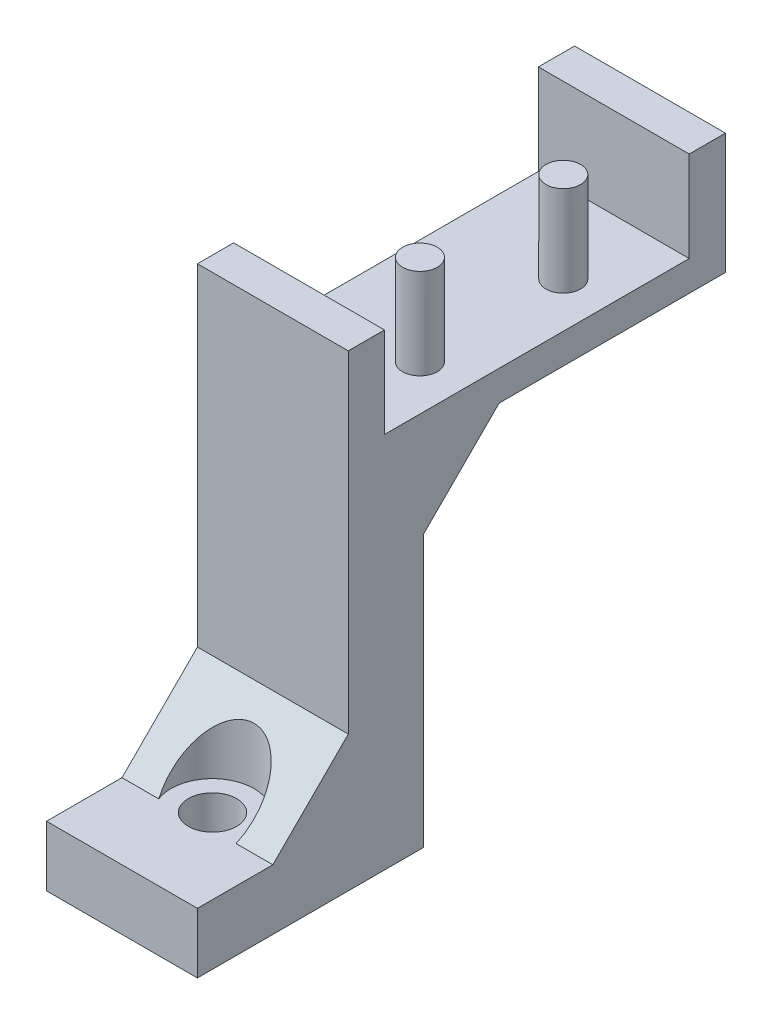
ISO-10303-21;
HEADER;
FILE_DESCRIPTION(('STEP AP214'),'2;1');
FILE_NAME('part.step','',(''),(''),'','','');
FILE_SCHEMA(('AUTOMOTIVE_DESIGN { 1 0 10303 214 1 1 1 1 }'));
ENDSEC;
DATA;
#1=APPLICATION_CONTEXT('core data for automotive mechanical design processes');
#2=APPLICATION_PROTOCOL_DEFINITION('international standard','automotive_design',2000,#1);
#3=PRODUCT_CONTEXT('',#1,'mechanical');
#4=PRODUCT('Part','Part','',(#3));
#5=PRODUCT_RELATED_PRODUCT_CATEGORY('part','',(#4));
#6=PRODUCT_DEFINITION_FORMATION('','',#4);
#7=PRODUCT_DEFINITION_CONTEXT('part definition',#1,'design');
#8=PRODUCT_DEFINITION('design','',#6,#7);
#9=PRODUCT_DEFINITION_SHAPE('','',#8);
#10=(LENGTH_UNIT() NAMED_UNIT(*) SI_UNIT(.MILLI.,.METRE.));
#11=(NAMED_UNIT(*) PLANE_ANGLE_UNIT() SI_UNIT($,.RADIAN.));
#12=(NAMED_UNIT(*) SI_UNIT($,.STERADIAN.) SOLID_ANGLE_UNIT());
#13=UNCERTAINTY_MEASURE_WITH_UNIT(LENGTH_MEASURE(1.E-05),#10,'distance_accuracy_value','');
#14=(GEOMETRIC_REPRESENTATION_CONTEXT(3) GLOBAL_UNCERTAINTY_ASSIGNED_CONTEXT((#13)) GLOBAL_UNIT_ASSIGNED_CONTEXT((#10,
#11,#12)) REPRESENTATION_CONTEXT('',''));
#15=CARTESIAN_POINT('',(0.,0.,0.));
#16=DIRECTION('',(0.,0.,1.));
#17=DIRECTION('',(1.,0.,0.));
#18=AXIS2_PLACEMENT_3D('',#15,#16,#17);
#19=CARTESIAN_POINT('',(5.,4.,-4.99999999999996));
#20=DIRECTION('',(0.,0.707106781186552,0.707106781186544));
#21=DIRECTION('',(1.,0.,0.));
#22=AXIS2_PLACEMENT_3D('',#19,#20,#21);
#23=PLANE('',#22);
#24=CARTESIAN_POINT('',(0.,5.00000000000003,-6.));
#25=DIRECTION('',(0.,0.707106781186552,0.707106781186544));
#26=DIRECTION('',(0.,-0.707106781186544,0.707106781186552));
#27=AXIS2_PLACEMENT_3D('',#24,#25,#26);
#28=ELLIPSE('',#27,3.88908729652599,2.75);
#29=CARTESIAN_POINT('',(2.56173769148988,4.,-4.99999999999996));
#30=VERTEX_POINT('',#29);
#31=CARTESIAN_POINT('',(-2.56173769148988,4.,-4.99999999999996));
#32=VERTEX_POINT('',#31);
#33=EDGE_CURVE('E11',#30,#32,#28,.T.);
#34=ORIENTED_EDGE('',*,*,#33,.F.);
#35=DIRECTION('',(-1.,0.,0.));
#36=VECTOR('',#35,1.);
#37=CARTESIAN_POINT('',(-5.,4.,-4.99999999999996));
#38=LINE('',#37,#36);
#39=CARTESIAN_POINT('',(5.,4.,-4.99999999999996));
#40=VERTEX_POINT('',#39);
#41=EDGE_CURVE('E164',#40,#30,#38,.T.);
#42=ORIENTED_EDGE('',*,*,#41,.F.);
#43=DIRECTION('',(0.,0.707106781186544,-0.707106781186552));
#44=VECTOR('',#43,1.);
#45=CARTESIAN_POINT('',(5.,4.,-4.99999999999996));
#46=LINE('',#45,#44);
#47=CARTESIAN_POINT('',(5.,8.99999999999998,-10.));
#48=VERTEX_POINT('',#47);
#49=EDGE_CURVE('E191',#48,#40,#46,.F.);
#50=ORIENTED_EDGE('',*,*,#49,.F.);
#51=DIRECTION('',(1.,0.,0.));
#52=VECTOR('',#51,1.);
#53=CARTESIAN_POINT('',(5.,8.99999999999998,-10.));
#54=LINE('',#53,#52);
#55=CARTESIAN_POINT('',(-5.,8.99999999999998,-10.));
#56=VERTEX_POINT('',#55);
#57=EDGE_CURVE('E173',#56,#48,#54,.T.);
#58=ORIENTED_EDGE('',*,*,#57,.F.);
#59=DIRECTION('',(0.,-0.707106781186544,0.707106781186552));
#60=VECTOR('',#59,1.);
#61=CARTESIAN_POINT('',(-5.,-0.499999999999958,-0.499999999999952));
#62=LINE('',#61,#60);
#63=CARTESIAN_POINT('',(-5.,4.,-4.99999999999996));
#64=VERTEX_POINT('',#63);
#65=EDGE_CURVE('E188',#64,#56,#62,.F.);
#66=ORIENTED_EDGE('',*,*,#65,.F.);
#67=EDGE_CURVE('E166',#32,#64,#38,.T.);
#68=ORIENTED_EDGE('',*,*,#67,.F.);
#69=EDGE_LOOP('',(#34,#42,#50,#58,#66,#68));
#70=FACE_BOUND('',#69,.T.);
#71=ADVANCED_FACE('F43',(#70),#23,.T.);
#72=CARTESIAN_POINT('',(0.,31.,-6.));
#73=DIRECTION('',(0.,-1.,0.));
#74=DIRECTION('',(0.,0.,-1.));
#75=AXIS2_PLACEMENT_3D('',#72,#73,#74);
#76=CYLINDRICAL_SURFACE('',#75,1.6);
#77=CARTESIAN_POINT('',(0.,0.,-6.));
#78=DIRECTION('',(0.,-1.,0.));
#79=DIRECTION('',(0.,0.,-1.));
#80=AXIS2_PLACEMENT_3D('',#77,#78,#79);
#81=CIRCLE('',#80,1.6);
#82=CARTESIAN_POINT('',(0.,0.,-7.6));
#83=VERTEX_POINT('',#82);
#84=EDGE_CURVE('E159',#83,#83,#81,.T.);
#85=ORIENTED_EDGE('',*,*,#84,.T.);
#86=EDGE_LOOP('',(#85));
#87=FACE_BOUND('',#86,.T.);
#88=CARTESIAN_POINT('',(0.,4.,-6.));
#89=DIRECTION('',(0.,-1.,0.));
#90=DIRECTION('',(0.,0.,-1.));
#91=AXIS2_PLACEMENT_3D('',#88,#89,#90);
#92=CIRCLE('',#91,1.6);
#93=CARTESIAN_POINT('',(0.,4.,-7.6));
#94=VERTEX_POINT('',#93);
#95=EDGE_CURVE('E417',#94,#94,#92,.T.);
#96=ORIENTED_EDGE('',*,*,#95,.F.);
#97=EDGE_LOOP('',(#96));
#98=FACE_BOUND('',#97,.T.);
#99=ADVANCED_FACE('F225',(#87,#98),#76,.F.);
#100=CARTESIAN_POINT('',(5.,31.,-35.));
#101=DIRECTION('',(0.,-1.,0.));
#102=DIRECTION('',(0.,0.,-1.));
#103=AXIS2_PLACEMENT_3D('',#100,#101,#102);
#104=PLANE('',#103);
#105=DIRECTION('',(0.,0.,1.));
#106=VECTOR('',#105,1.);
#107=CARTESIAN_POINT('',(-5.,31.,-35.));
#108=LINE('',#107,#106);
#109=CARTESIAN_POINT('',(-5.,31.,-35.));
#110=VERTEX_POINT('',#109);
#111=CARTESIAN_POINT('',(-5.,31.,-32.6));
#112=VERTEX_POINT('',#111);
#113=EDGE_CURVE('E335',#110,#112,#108,.T.);
#114=ORIENTED_EDGE('',*,*,#113,.T.);
#115=DIRECTION('',(-1.,0.,0.));
#116=VECTOR('',#115,1.);
#117=CARTESIAN_POINT('',(-5.,31.,-32.6));
#118=LINE('',#117,#116);
#119=CARTESIAN_POINT('',(5.,31.,-32.6));
#120=VERTEX_POINT('',#119);
#121=EDGE_CURVE('E394',#120,#112,#118,.T.);
#122=ORIENTED_EDGE('',*,*,#121,.F.);
#123=DIRECTION('',(0.,0.,1.));
#124=VECTOR('',#123,1.);
#125=CARTESIAN_POINT('',(5.,31.,-35.));
#126=LINE('',#125,#124);
#127=CARTESIAN_POINT('',(5.,31.,-35.));
#128=VERTEX_POINT('',#127);
#129=EDGE_CURVE('E363',#128,#120,#126,.T.);
#130=ORIENTED_EDGE('',*,*,#129,.F.);
#131=DIRECTION('',(-1.,0.,0.));
#132=VECTOR('',#131,1.);
#133=CARTESIAN_POINT('',(5.,31.,-35.));
#134=LINE('',#133,#132);
#135=EDGE_CURVE('E315',#128,#110,#134,.T.);
#136=ORIENTED_EDGE('',*,*,#135,.T.);
#137=EDGE_LOOP('',(#114,#122,#130,#136));
#138=FACE_BOUND('',#137,.T.);
#139=ADVANCED_FACE('F229',(#138),#104,.F.);
#140=CARTESIAN_POINT('',(5.,4.,0.));
#141=DIRECTION('',(0.,0.,-1.));
#142=DIRECTION('',(-1.,0.,0.));
#143=AXIS2_PLACEMENT_3D('',#140,#141,#142);
#144=PLANE('',#143);
#145=DIRECTION('',(0.,-1.,0.));
#146=VECTOR('',#145,1.);
#147=CARTESIAN_POINT('',(-5.,4.,0.));
#148=LINE('',#147,#146);
#149=CARTESIAN_POINT('',(-5.,4.,0.));
#150=VERTEX_POINT('',#149);
#151=CARTESIAN_POINT('',(-5.,0.,0.));
#152=VERTEX_POINT('',#151);
#153=EDGE_CURVE('E352',#150,#152,#148,.T.);
#154=ORIENTED_EDGE('',*,*,#153,.T.);
#155=DIRECTION('',(-1.,0.,0.));
#156=VECTOR('',#155,1.);
#157=CARTESIAN_POINT('',(5.,0.,0.));
#158=LINE('',#157,#156);
#159=CARTESIAN_POINT('',(5.,0.,0.));
#160=VERTEX_POINT('',#159);
#161=EDGE_CURVE('E302',#160,#152,#158,.T.);
#162=ORIENTED_EDGE('',*,*,#161,.F.);
#163=DIRECTION('',(0.,-1.,0.));
#164=VECTOR('',#163,1.);
#165=CARTESIAN_POINT('',(5.,4.,0.));
#166=LINE('',#165,#164);
#167=CARTESIAN_POINT('',(5.,4.,0.));
#168=VERTEX_POINT('',#167);
#169=EDGE_CURVE('E330',#168,#160,#166,.T.);
#170=ORIENTED_EDGE('',*,*,#169,.F.);
#171=DIRECTION('',(-1.,0.,0.));
#172=VECTOR('',#171,1.);
#173=CARTESIAN_POINT('',(5.,4.,0.));
#174=LINE('',#173,#172);
#175=EDGE_CURVE('E323',#168,#150,#174,.T.);
#176=ORIENTED_EDGE('',*,*,#175,.T.);
#177=EDGE_LOOP('',(#154,#162,#170,#176));
#178=FACE_BOUND('',#177,.T.);
#179=ADVANCED_FACE('F236',(#178),#144,.F.);
#180=CARTESIAN_POINT('',(5.,0.,0.));
#181=DIRECTION('',(0.,1.,0.));
#182=DIRECTION('',(0.,0.,1.));
#183=AXIS2_PLACEMENT_3D('',#180,#181,#182);
#184=PLANE('',#183);
#185=ORIENTED_EDGE('',*,*,#84,.F.);
#186=EDGE_LOOP('',(#185));
#187=FACE_BOUND('',#186,.T.);
#188=DIRECTION('',(0.,0.,-1.));
#189=VECTOR('',#188,1.);
#190=CARTESIAN_POINT('',(-5.,0.,0.));
#191=LINE('',#190,#189);
#192=CARTESIAN_POINT('',(-5.,0.,-15.));
#193=VERTEX_POINT('',#192);
#194=EDGE_CURVE('E349',#152,#193,#191,.T.);
#195=ORIENTED_EDGE('',*,*,#194,.T.);
#196=DIRECTION('',(-1.,0.,0.));
#197=VECTOR('',#196,1.);
#198=CARTESIAN_POINT('',(5.,0.,-15.));
#199=LINE('',#198,#197);
#200=CARTESIAN_POINT('',(5.,0.,-15.));
#201=VERTEX_POINT('',#200);
#202=EDGE_CURVE('E307',#201,#193,#199,.T.);
#203=ORIENTED_EDGE('',*,*,#202,.F.);
#204=DIRECTION('',(0.,0.,-1.));
#205=VECTOR('',#204,1.);
#206=CARTESIAN_POINT('',(5.,0.,0.));
#207=LINE('',#206,#205);
#208=EDGE_CURVE('E372',#160,#201,#207,.T.);
#209=ORIENTED_EDGE('',*,*,#208,.F.);
#210=ORIENTED_EDGE('',*,*,#161,.T.);
#211=EDGE_LOOP('',(#195,#203,#209,#210));
#212=FACE_BOUND('',#211,.T.);
#213=ADVANCED_FACE('F239',(#187,#212),#184,.F.);
#214=CARTESIAN_POINT('',(5.,0.,-15.));
#215=DIRECTION('',(0.,0.,1.));
#216=DIRECTION('',(1.,0.,0.));
#217=AXIS2_PLACEMENT_3D('',#214,#215,#216);
#218=PLANE('',#217);
#219=DIRECTION('',(0.,1.,0.));
#220=VECTOR('',#219,1.);
#221=CARTESIAN_POINT('',(-5.,0.,-15.));
#222=LINE('',#221,#220);
#223=CARTESIAN_POINT('',(-5.,18.,-15.));
#224=VERTEX_POINT('',#223);
#225=EDGE_CURVE('E346',#193,#224,#222,.T.);
#226=ORIENTED_EDGE('',*,*,#225,.T.);
#227=DIRECTION('',(1.,0.,0.));
#228=VECTOR('',#227,1.);
#229=CARTESIAN_POINT('',(5.,18.,-15.));
#230=LINE('',#229,#228);
#231=CARTESIAN_POINT('',(5.,18.,-15.));
#232=VERTEX_POINT('',#231);
#233=EDGE_CURVE('E60',#224,#232,#230,.T.);
#234=ORIENTED_EDGE('',*,*,#233,.T.);
#235=DIRECTION('',(0.,1.,0.));
#236=VECTOR('',#235,1.);
#237=CARTESIAN_POINT('',(5.,0.,-15.));
#238=LINE('',#237,#236);
#239=EDGE_CURVE('E203',#201,#232,#238,.T.);
#240=ORIENTED_EDGE('',*,*,#239,.F.);
#241=ORIENTED_EDGE('',*,*,#202,.T.);
#242=EDGE_LOOP('',(#226,#234,#240,#241));
#243=FACE_BOUND('',#242,.T.);
#244=ADVANCED_FACE('F243',(#243),#218,.F.);
#245=CARTESIAN_POINT('',(5.,23.,-15.));
#246=DIRECTION('',(0.,1.,0.));
#247=DIRECTION('',(0.,0.,1.));
#248=AXIS2_PLACEMENT_3D('',#245,#246,#247);
#249=PLANE('',#248);
#250=DIRECTION('',(0.,0.,-1.));
#251=VECTOR('',#250,1.);
#252=CARTESIAN_POINT('',(5.,23.,-15.));
#253=LINE('',#252,#251);
#254=CARTESIAN_POINT('',(5.,23.,-20.));
#255=VERTEX_POINT('',#254);
#256=CARTESIAN_POINT('',(5.,23.,-35.));
#257=VERTEX_POINT('',#256);
#258=EDGE_CURVE('E201',#255,#257,#253,.T.);
#259=ORIENTED_EDGE('',*,*,#258,.F.);
#260=DIRECTION('',(-1.,0.,0.));
#261=VECTOR('',#260,1.);
#262=CARTESIAN_POINT('',(-5.,23.,-20.));
#263=LINE('',#262,#261);
#264=CARTESIAN_POINT('',(-5.,23.,-20.));
#265=VERTEX_POINT('',#264);
#266=EDGE_CURVE('E177',#255,#265,#263,.T.);
#267=ORIENTED_EDGE('',*,*,#266,.T.);
#268=DIRECTION('',(0.,0.,-1.));
#269=VECTOR('',#268,1.);
#270=CARTESIAN_POINT('',(-5.,23.,-15.));
#271=LINE('',#270,#269);
#272=CARTESIAN_POINT('',(-5.,23.,-35.));
#273=VERTEX_POINT('',#272);
#274=EDGE_CURVE('E343',#265,#273,#271,.T.);
#275=ORIENTED_EDGE('',*,*,#274,.T.);
#276=DIRECTION('',(-1.,0.,0.));
#277=VECTOR('',#276,1.);
#278=CARTESIAN_POINT('',(5.,23.,-35.));
#279=LINE('',#278,#277);
#280=EDGE_CURVE('E209',#257,#273,#279,.T.);
#281=ORIENTED_EDGE('',*,*,#280,.F.);
#282=EDGE_LOOP('',(#259,#267,#275,#281));
#283=FACE_BOUND('',#282,.T.);
#284=ADVANCED_FACE('F207',(#283),#249,.F.);
#285=CARTESIAN_POINT('',(5.,23.,-35.));
#286=DIRECTION('',(0.,0.,1.));
#287=DIRECTION('',(1.,0.,0.));
#288=AXIS2_PLACEMENT_3D('',#285,#286,#287);
#289=PLANE('',#288);
#290=DIRECTION('',(0.,1.,0.));
#291=VECTOR('',#290,1.);
#292=CARTESIAN_POINT('',(-5.,23.,-35.));
#293=LINE('',#292,#291);
#294=EDGE_CURVE('E340',#273,#110,#293,.T.);
#295=ORIENTED_EDGE('',*,*,#294,.T.);
#296=ORIENTED_EDGE('',*,*,#135,.F.);
#297=DIRECTION('',(0.,1.,0.));
#298=VECTOR('',#297,1.);
#299=CARTESIAN_POINT('',(5.,23.,-35.));
#300=LINE('',#299,#298);
#301=EDGE_CURVE('E212',#257,#128,#300,.T.);
#302=ORIENTED_EDGE('',*,*,#301,.F.);
#303=ORIENTED_EDGE('',*,*,#280,.T.);
#304=EDGE_LOOP('',(#295,#296,#302,#303));
#305=FACE_BOUND('',#304,.T.);
#306=ADVANCED_FACE('F249',(#305),#289,.F.);
#307=CARTESIAN_POINT('',(5.,31.,-12.4));
#308=VERTEX_POINT('',#307);
#309=CARTESIAN_POINT('',(5.,31.,-10.));
#310=VERTEX_POINT('',#309);
#311=EDGE_CURVE('E367',#308,#310,#126,.T.);
#312=ORIENTED_EDGE('',*,*,#311,.F.);
#313=DIRECTION('',(1.,0.,0.));
#314=VECTOR('',#313,1.);
#315=CARTESIAN_POINT('',(15.,31.,-12.4));
#316=LINE('',#315,#314);
#317=CARTESIAN_POINT('',(-5.,31.,-12.4));
#318=VERTEX_POINT('',#317);
#319=EDGE_CURVE('E398',#318,#308,#316,.T.);
#320=ORIENTED_EDGE('',*,*,#319,.F.);
#321=CARTESIAN_POINT('',(-5.,31.,-10.));
#322=VERTEX_POINT('',#321);
#323=EDGE_CURVE('E339',#318,#322,#108,.T.);
#324=ORIENTED_EDGE('',*,*,#323,.T.);
#325=DIRECTION('',(-1.,0.,0.));
#326=VECTOR('',#325,1.);
#327=CARTESIAN_POINT('',(5.,31.,-10.));
#328=LINE('',#327,#326);
#329=EDGE_CURVE('E319',#310,#322,#328,.T.);
#330=ORIENTED_EDGE('',*,*,#329,.F.);
#331=EDGE_LOOP('',(#312,#320,#324,#330));
#332=FACE_BOUND('',#331,.T.);
#333=ADVANCED_FACE('F252',(#332),#104,.F.);
#334=CARTESIAN_POINT('',(5.,31.,-10.));
#335=DIRECTION('',(0.,0.,-1.));
#336=DIRECTION('',(0.,1.,0.));
#337=AXIS2_PLACEMENT_3D('',#334,#335,#336);
#338=PLANE('',#337);
#339=DIRECTION('',(0.,-1.,0.));
#340=VECTOR('',#339,1.);
#341=CARTESIAN_POINT('',(-5.,31.,-10.));
#342=LINE('',#341,#340);
#343=EDGE_CURVE('E331',#322,#56,#342,.T.);
#344=ORIENTED_EDGE('',*,*,#343,.T.);
#345=ORIENTED_EDGE('',*,*,#57,.T.);
#346=DIRECTION('',(0.,-1.,0.));
#347=VECTOR('',#346,1.);
#348=CARTESIAN_POINT('',(5.,31.,-10.));
#349=LINE('',#348,#347);
#350=EDGE_CURVE('E359',#310,#48,#349,.T.);
#351=ORIENTED_EDGE('',*,*,#350,.F.);
#352=ORIENTED_EDGE('',*,*,#329,.T.);
#353=EDGE_LOOP('',(#344,#345,#351,#352));
#354=FACE_BOUND('',#353,.T.);
#355=ADVANCED_FACE('F256',(#354),#338,.F.);
#356=CARTESIAN_POINT('',(5.,4.,-10.));
#357=DIRECTION('',(0.,-1.,0.));
#358=DIRECTION('',(0.,0.,-1.));
#359=AXIS2_PLACEMENT_3D('',#356,#357,#358);
#360=PLANE('',#359);
#361=ORIENTED_EDGE('',*,*,#41,.T.);
#362=CARTESIAN_POINT('',(0.,4.,-6.));
#363=DIRECTION('',(0.,1.,0.));
#364=DIRECTION('',(0.,0.,1.));
#365=AXIS2_PLACEMENT_3D('',#362,#363,#364);
#366=CIRCLE('',#365,2.75);
#367=EDGE_CURVE('E152',#30,#32,#366,.T.);
#368=ORIENTED_EDGE('',*,*,#367,.T.);
#369=ORIENTED_EDGE('',*,*,#67,.T.);
#370=DIRECTION('',(0.,0.,1.));
#371=VECTOR('',#370,1.);
#372=CARTESIAN_POINT('',(-5.,4.,-10.));
#373=LINE('',#372,#371);
#374=EDGE_CURVE('E327',#64,#150,#373,.T.);
#375=ORIENTED_EDGE('',*,*,#374,.T.);
#376=ORIENTED_EDGE('',*,*,#175,.F.);
#377=DIRECTION('',(0.,0.,1.));
#378=VECTOR('',#377,1.);
#379=CARTESIAN_POINT('',(5.,4.,-10.));
#380=LINE('',#379,#378);
#381=EDGE_CURVE('E171',#40,#168,#380,.T.);
#382=ORIENTED_EDGE('',*,*,#381,.F.);
#383=EDGE_LOOP('',(#361,#368,#369,#375,#376,#382));
#384=FACE_BOUND('',#383,.T.);
#385=ORIENTED_EDGE('',*,*,#95,.T.);
#386=EDGE_LOOP('',(#385));
#387=FACE_BOUND('',#386,.T.);
#388=ADVANCED_FACE('F168',(#384,#387),#360,.F.);
#389=CARTESIAN_POINT('',(5.,0.,0.));
#390=DIRECTION('',(1.,0.,0.));
#391=DIRECTION('',(0.,0.,-1.));
#392=AXIS2_PLACEMENT_3D('',#389,#390,#391);
#393=PLANE('',#392);
#394=DIRECTION('',(0.,1.,0.));
#395=VECTOR('',#394,1.);
#396=CARTESIAN_POINT('',(5.,0.,-32.6));
#397=LINE('',#396,#395);
#398=CARTESIAN_POINT('',(5.,25.,-32.6));
#399=VERTEX_POINT('',#398);
#400=EDGE_CURVE('E356',#399,#120,#397,.T.);
#401=ORIENTED_EDGE('',*,*,#400,.F.);
#402=DIRECTION('',(0.,0.,-1.));
#403=VECTOR('',#402,1.);
#404=CARTESIAN_POINT('',(5.,25.,0.));
#405=LINE('',#404,#403);
#406=CARTESIAN_POINT('',(5.,25.,-12.4));
#407=VERTEX_POINT('',#406);
#408=EDGE_CURVE('E383',#407,#399,#405,.T.);
#409=ORIENTED_EDGE('',*,*,#408,.F.);
#410=DIRECTION('',(0.,-1.,0.));
#411=VECTOR('',#410,1.);
#412=CARTESIAN_POINT('',(5.,0.,-12.4));
#413=LINE('',#412,#411);
#414=EDGE_CURVE('E380',#308,#407,#413,.T.);
#415=ORIENTED_EDGE('',*,*,#414,.F.);
#416=ORIENTED_EDGE('',*,*,#311,.T.);
#417=ORIENTED_EDGE('',*,*,#350,.T.);
#418=ORIENTED_EDGE('',*,*,#49,.T.);
#419=ORIENTED_EDGE('',*,*,#381,.T.);
#420=ORIENTED_EDGE('',*,*,#169,.T.);
#421=ORIENTED_EDGE('',*,*,#208,.T.);
#422=ORIENTED_EDGE('',*,*,#239,.T.);
#423=DIRECTION('',(0.,-0.707106781186544,0.707106781186551));
#424=VECTOR('',#423,1.);
#425=CARTESIAN_POINT('',(5.,23.,-20.));
#426=LINE('',#425,#424);
#427=EDGE_CURVE('E53',#232,#255,#426,.F.);
#428=ORIENTED_EDGE('',*,*,#427,.T.);
#429=ORIENTED_EDGE('',*,*,#258,.T.);
#430=ORIENTED_EDGE('',*,*,#301,.T.);
#431=ORIENTED_EDGE('',*,*,#129,.T.);
#432=EDGE_LOOP('',(#401,#409,#415,#416,#417,#418,#419,#420,#421,#422,#428,#429,#430,#431));
#433=FACE_BOUND('',#432,.T.);
#434=ADVANCED_FACE('F200',(#433),#393,.T.);
#435=CARTESIAN_POINT('',(-5.,0.,0.));
#436=DIRECTION('',(1.,0.,0.));
#437=DIRECTION('',(0.,0.,-1.));
#438=AXIS2_PLACEMENT_3D('',#435,#436,#437);
#439=PLANE('',#438);
#440=DIRECTION('',(0.,0.,1.));
#441=VECTOR('',#440,1.);
#442=CARTESIAN_POINT('',(-5.,25.,-12.4));
#443=LINE('',#442,#441);
#444=CARTESIAN_POINT('',(-5.,25.,-32.6));
#445=VERTEX_POINT('',#444);
#446=CARTESIAN_POINT('',(-5.,25.,-12.4));
#447=VERTEX_POINT('',#446);
#448=EDGE_CURVE('E397',#445,#447,#443,.T.);
#449=ORIENTED_EDGE('',*,*,#448,.F.);
#450=DIRECTION('',(0.,1.,0.));
#451=VECTOR('',#450,1.);
#452=CARTESIAN_POINT('',(-5.,25.,-32.6));
#453=LINE('',#452,#451);
#454=EDGE_CURVE('E386',#445,#112,#453,.T.);
#455=ORIENTED_EDGE('',*,*,#454,.T.);
#456=ORIENTED_EDGE('',*,*,#113,.F.);
#457=ORIENTED_EDGE('',*,*,#294,.F.);
#458=ORIENTED_EDGE('',*,*,#274,.F.);
#459=DIRECTION('',(0.,0.707106781186544,-0.707106781186551));
#460=VECTOR('',#459,1.);
#461=CARTESIAN_POINT('',(-5.,1.50000000000011,1.50000000000009));
#462=LINE('',#461,#460);
#463=EDGE_CURVE('E68',#265,#224,#462,.F.);
#464=ORIENTED_EDGE('',*,*,#463,.T.);
#465=ORIENTED_EDGE('',*,*,#225,.F.);
#466=ORIENTED_EDGE('',*,*,#194,.F.);
#467=ORIENTED_EDGE('',*,*,#153,.F.);
#468=ORIENTED_EDGE('',*,*,#374,.F.);
#469=ORIENTED_EDGE('',*,*,#65,.T.);
#470=ORIENTED_EDGE('',*,*,#343,.F.);
#471=ORIENTED_EDGE('',*,*,#323,.F.);
#472=DIRECTION('',(0.,1.,0.));
#473=VECTOR('',#472,1.);
#474=CARTESIAN_POINT('',(-5.,25.,-12.4));
#475=LINE('',#474,#473);
#476=EDGE_CURVE('E387',#447,#318,#475,.T.);
#477=ORIENTED_EDGE('',*,*,#476,.F.);
#478=EDGE_LOOP('',(#449,#455,#456,#457,#458,#464,#465,#466,#467,#468,#469,#470,#471,#477));
#479=FACE_BOUND('',#478,.T.);
#480=ADVANCED_FACE('F263',(#479),#439,.F.);
#481=CARTESIAN_POINT('',(-5.,25.,-32.6));
#482=DIRECTION('',(0.,0.,-1.));
#483=DIRECTION('',(-1.,0.,0.));
#484=AXIS2_PLACEMENT_3D('',#481,#482,#483);
#485=PLANE('',#484);
#486=ORIENTED_EDGE('',*,*,#400,.T.);
#487=ORIENTED_EDGE('',*,*,#121,.T.);
#488=ORIENTED_EDGE('',*,*,#454,.F.);
#489=DIRECTION('',(-1.,0.,0.));
#490=VECTOR('',#489,1.);
#491=CARTESIAN_POINT('',(-5.,25.,-32.6));
#492=LINE('',#491,#490);
#493=EDGE_CURVE('E390',#399,#445,#492,.T.);
#494=ORIENTED_EDGE('',*,*,#493,.F.);
#495=EDGE_LOOP('',(#486,#487,#488,#494));
#496=FACE_BOUND('',#495,.T.);
#497=ADVANCED_FACE('F266',(#496),#485,.F.);
#498=CARTESIAN_POINT('',(15.,25.,-12.4));
#499=DIRECTION('',(0.,0.,1.));
#500=DIRECTION('',(1.,0.,0.));
#501=AXIS2_PLACEMENT_3D('',#498,#499,#500);
#502=PLANE('',#501);
#503=ORIENTED_EDGE('',*,*,#414,.T.);
#504=DIRECTION('',(1.,0.,0.));
#505=VECTOR('',#504,1.);
#506=CARTESIAN_POINT('',(15.,25.,-12.4));
#507=LINE('',#506,#505);
#508=EDGE_CURVE('E405',#447,#407,#507,.T.);
#509=ORIENTED_EDGE('',*,*,#508,.F.);
#510=ORIENTED_EDGE('',*,*,#476,.T.);
#511=ORIENTED_EDGE('',*,*,#319,.T.);
#512=EDGE_LOOP('',(#503,#509,#510,#511));
#513=FACE_BOUND('',#512,.T.);
#514=ADVANCED_FACE('F269',(#513),#502,.F.);
#515=CARTESIAN_POINT('',(0.,25.,0.));
#516=DIRECTION('',(0.,-1.,0.));
#517=DIRECTION('',(0.,0.,-1.));
#518=AXIS2_PLACEMENT_3D('',#515,#516,#517);
#519=PLANE('',#518);
#520=CARTESIAN_POINT('',(2.,25.,-17.75));
#521=DIRECTION('',(0.,-1.,0.));
#522=DIRECTION('',(0.,0.,-1.));
#523=AXIS2_PLACEMENT_3D('',#520,#521,#522);
#524=CIRCLE('',#523,1.15);
#525=CARTESIAN_POINT('',(2.,25.,-18.9));
#526=VERTEX_POINT('',#525);
#527=EDGE_CURVE('E179',#526,#526,#524,.F.);
#528=ORIENTED_EDGE('',*,*,#527,.F.);
#529=EDGE_LOOP('',(#528));
#530=FACE_BOUND('',#529,.T.);
#531=CARTESIAN_POINT('',(2.,25.,-27.25));
#532=DIRECTION('',(0.,-1.,0.));
#533=DIRECTION('',(0.,0.,-1.));
#534=AXIS2_PLACEMENT_3D('',#531,#532,#533);
#535=CIRCLE('',#534,1.15);
#536=CARTESIAN_POINT('',(2.,25.,-28.4));
#537=VERTEX_POINT('',#536);
#538=EDGE_CURVE('E299',#537,#537,#535,.F.);
#539=ORIENTED_EDGE('',*,*,#538,.F.);
#540=EDGE_LOOP('',(#539));
#541=FACE_BOUND('',#540,.T.);
#542=ORIENTED_EDGE('',*,*,#408,.T.);
#543=ORIENTED_EDGE('',*,*,#493,.T.);
#544=ORIENTED_EDGE('',*,*,#448,.T.);
#545=ORIENTED_EDGE('',*,*,#508,.T.);
#546=EDGE_LOOP('',(#542,#543,#544,#545));
#547=FACE_BOUND('',#546,.T.);
#548=ADVANCED_FACE('F272',(#530,#541,#547),#519,.F.);
#549=CARTESIAN_POINT('',(2.,31.,-27.25));
#550=DIRECTION('',(0.,-1.,0.));
#551=DIRECTION('',(0.,0.,-1.));
#552=AXIS2_PLACEMENT_3D('',#549,#550,#551);
#553=CYLINDRICAL_SURFACE('',#552,1.15);
#554=CARTESIAN_POINT('',(2.,31.,-27.25));
#555=DIRECTION('',(0.,1.,0.));
#556=DIRECTION('',(0.,0.,1.));
#557=AXIS2_PLACEMENT_3D('',#554,#555,#556);
#558=CIRCLE('',#557,1.15);
#559=CARTESIAN_POINT('',(2.,31.,-26.1));
#560=VERTEX_POINT('',#559);
#561=EDGE_CURVE('E401',#560,#560,#558,.T.);
#562=ORIENTED_EDGE('',*,*,#561,.F.);
#563=EDGE_LOOP('',(#562));
#564=FACE_BOUND('',#563,.T.);
#565=ORIENTED_EDGE('',*,*,#538,.T.);
#566=EDGE_LOOP('',(#565));
#567=FACE_BOUND('',#566,.T.);
#568=ADVANCED_FACE('F279',(#564,#567),#553,.T.);
#569=CARTESIAN_POINT('',(2.,31.,-27.25));
#570=DIRECTION('',(0.,1.,0.));
#571=DIRECTION('',(0.,0.,1.));
#572=AXIS2_PLACEMENT_3D('',#569,#570,#571);
#573=PLANE('',#572);
#574=ORIENTED_EDGE('',*,*,#561,.T.);
#575=EDGE_LOOP('',(#574));
#576=FACE_BOUND('',#575,.T.);
#577=ADVANCED_FACE('F283',(#576),#573,.T.);
#578=CARTESIAN_POINT('',(2.,31.,-17.75));
#579=DIRECTION('',(0.,-1.,0.));
#580=DIRECTION('',(0.,0.,-1.));
#581=AXIS2_PLACEMENT_3D('',#578,#579,#580);
#582=CYLINDRICAL_SURFACE('',#581,1.15);
#583=CARTESIAN_POINT('',(2.,31.,-17.75));
#584=DIRECTION('',(0.,1.,0.));
#585=DIRECTION('',(0.,0.,1.));
#586=AXIS2_PLACEMENT_3D('',#583,#584,#585);
#587=CIRCLE('',#586,1.15);
#588=CARTESIAN_POINT('',(2.,31.,-16.6));
#589=VERTEX_POINT('',#588);
#590=EDGE_CURVE('E295',#589,#589,#587,.T.);
#591=ORIENTED_EDGE('',*,*,#590,.F.);
#592=EDGE_LOOP('',(#591));
#593=FACE_BOUND('',#592,.T.);
#594=ORIENTED_EDGE('',*,*,#527,.T.);
#595=EDGE_LOOP('',(#594));
#596=FACE_BOUND('',#595,.T.);
#597=ADVANCED_FACE('F221',(#593,#596),#582,.T.);
#598=CARTESIAN_POINT('',(2.,31.,-17.75));
#599=DIRECTION('',(0.,1.,0.));
#600=DIRECTION('',(0.,0.,1.));
#601=AXIS2_PLACEMENT_3D('',#598,#599,#600);
#602=PLANE('',#601);
#603=ORIENTED_EDGE('',*,*,#590,.T.);
#604=EDGE_LOOP('',(#603));
#605=FACE_BOUND('',#604,.T.);
#606=ADVANCED_FACE('F215',(#605),#602,.T.);
#607=CARTESIAN_POINT('',(5.,23.,-20.));
#608=DIRECTION('',(0.,-0.707106781186551,-0.707106781186544));
#609=DIRECTION('',(1.,0.,0.));
#610=AXIS2_PLACEMENT_3D('',#607,#608,#609);
#611=PLANE('',#610);
#612=ORIENTED_EDGE('',*,*,#427,.F.);
#613=ORIENTED_EDGE('',*,*,#233,.F.);
#614=ORIENTED_EDGE('',*,*,#463,.F.);
#615=ORIENTED_EDGE('',*,*,#266,.F.);
#616=EDGE_LOOP('',(#612,#613,#614,#615));
#617=FACE_BOUND('',#616,.T.);
#618=ADVANCED_FACE('F46',(#617),#611,.T.);
#619=CARTESIAN_POINT('',(0.,10.,-6.));
#620=DIRECTION('',(0.,-1.,0.));
#621=DIRECTION('',(0.,0.,-1.));
#622=AXIS2_PLACEMENT_3D('',#619,#620,#621);
#623=CYLINDRICAL_SURFACE('',#622,2.75);
#624=ORIENTED_EDGE('',*,*,#33,.T.);
#625=ORIENTED_EDGE('',*,*,#367,.F.);
#626=EDGE_LOOP('',(#624,#625));
#627=FACE_BOUND('',#626,.T.);
#628=ADVANCED_FACE('F154',(#627),#623,.F.);
#629=CLOSED_SHELL('',(#71,#99,#139,#179,#213,#244,#284,#306,#333,#355,#388,#434,#480,#497,#514,
#548,#568,#577,#597,#606,#618,#628));
#630=MANIFOLD_SOLID_BREP('B2',#629);
#631=ADVANCED_BREP_SHAPE_REPRESENTATION('',(#18,#630),#14);
#632=SHAPE_DEFINITION_REPRESENTATION(#9,#631);
ENDSEC;
END-ISO-10303-21;
